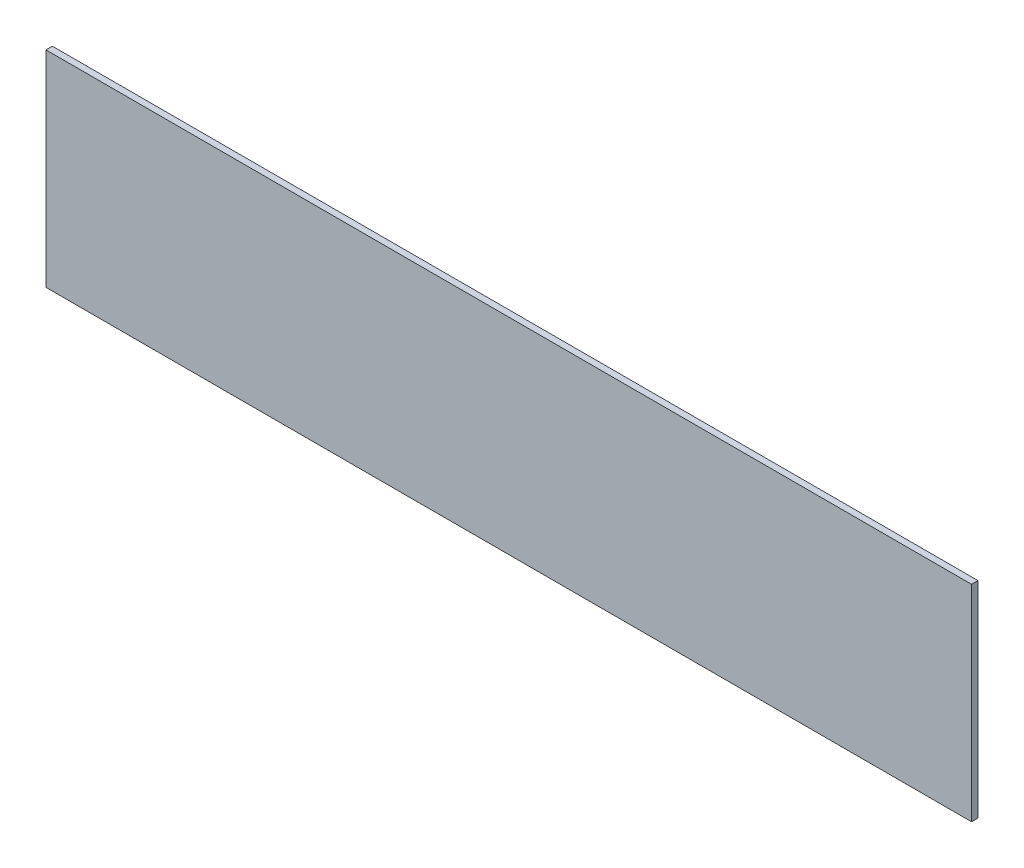
ISO-10303-21;
HEADER;
FILE_DESCRIPTION(('STEP AP214'),'2;1');
FILE_NAME('part.step','',(''),(''),'','','');
FILE_SCHEMA(('AUTOMOTIVE_DESIGN { 1 0 10303 214 1 1 1 1 }'));
ENDSEC;
DATA;
#1=APPLICATION_CONTEXT('core data for automotive mechanical design processes');
#2=APPLICATION_PROTOCOL_DEFINITION('international standard','automotive_design',2000,#1);
#3=PRODUCT_CONTEXT('',#1,'mechanical');
#4=PRODUCT('Part','Part','',(#3));
#5=PRODUCT_RELATED_PRODUCT_CATEGORY('part','',(#4));
#6=PRODUCT_DEFINITION_FORMATION('','',#4);
#7=PRODUCT_DEFINITION_CONTEXT('part definition',#1,'design');
#8=PRODUCT_DEFINITION('design','',#6,#7);
#9=PRODUCT_DEFINITION_SHAPE('','',#8);
#10=(LENGTH_UNIT() NAMED_UNIT(*) SI_UNIT(.MILLI.,.METRE.));
#11=(NAMED_UNIT(*) PLANE_ANGLE_UNIT() SI_UNIT($,.RADIAN.));
#12=(NAMED_UNIT(*) SI_UNIT($,.STERADIAN.) SOLID_ANGLE_UNIT());
#13=UNCERTAINTY_MEASURE_WITH_UNIT(LENGTH_MEASURE(1.E-05),#10,'distance_accuracy_value','');
#14=(GEOMETRIC_REPRESENTATION_CONTEXT(3) GLOBAL_UNCERTAINTY_ASSIGNED_CONTEXT((#13)) GLOBAL_UNIT_ASSIGNED_CONTEXT((#10,
#11,#12)) REPRESENTATION_CONTEXT('',''));
#15=CARTESIAN_POINT('',(0.,0.,0.));
#16=DIRECTION('',(0.,0.,1.));
#17=DIRECTION('',(1.,0.,0.));
#18=AXIS2_PLACEMENT_3D('',#15,#16,#17);
#19=CARTESIAN_POINT('',(0.,0.,1.5875));
#20=DIRECTION('',(-1.,0.,0.));
#21=DIRECTION('',(0.,0.,1.));
#22=AXIS2_PLACEMENT_3D('',#19,#20,#21);
#23=PLANE('',#22);
#24=DIRECTION('',(0.,1.,0.));
#25=VECTOR('',#24,1.);
#26=CARTESIAN_POINT('',(0.,0.,0.));
#27=LINE('',#26,#25);
#28=CARTESIAN_POINT('',(0.,-50.8,0.));
#29=VERTEX_POINT('',#28);
#30=CARTESIAN_POINT('',(0.,0.,0.));
#31=VERTEX_POINT('',#30);
#32=EDGE_CURVE('E97',#29,#31,#27,.T.);
#33=ORIENTED_EDGE('',*,*,#32,.T.);
#34=DIRECTION('',(0.,0.,-1.));
#35=VECTOR('',#34,1.);
#36=CARTESIAN_POINT('',(0.,0.,1.5875));
#37=LINE('',#36,#35);
#38=CARTESIAN_POINT('',(0.,0.,1.5875));
#39=VERTEX_POINT('',#38);
#40=EDGE_CURVE('E11',#39,#31,#37,.T.);
#41=ORIENTED_EDGE('',*,*,#40,.F.);
#42=DIRECTION('',(0.,1.,0.));
#43=VECTOR('',#42,1.);
#44=CARTESIAN_POINT('',(0.,0.,1.5875));
#45=LINE('',#44,#43);
#46=CARTESIAN_POINT('',(0.,-50.8,1.5875));
#47=VERTEX_POINT('',#46);
#48=EDGE_CURVE('E85',#47,#39,#45,.T.);
#49=ORIENTED_EDGE('',*,*,#48,.F.);
#50=DIRECTION('',(0.,0.,-1.));
#51=VECTOR('',#50,1.);
#52=CARTESIAN_POINT('',(0.,-50.8,1.5875));
#53=LINE('',#52,#51);
#54=EDGE_CURVE('E93',#47,#29,#53,.T.);
#55=ORIENTED_EDGE('',*,*,#54,.T.);
#56=EDGE_LOOP('',(#33,#41,#49,#55));
#57=FACE_BOUND('',#56,.T.);
#58=ADVANCED_FACE('F34',(#57),#23,.F.);
#59=CARTESIAN_POINT('',(0.,0.,1.5875));
#60=DIRECTION('',(0.,-1.,0.));
#61=DIRECTION('',(1.,0.,0.));
#62=AXIS2_PLACEMENT_3D('',#59,#60,#61);
#63=PLANE('',#62);
#64=DIRECTION('',(-1.,0.,0.));
#65=VECTOR('',#64,1.);
#66=CARTESIAN_POINT('',(0.,0.,0.));
#67=LINE('',#66,#65);
#68=CARTESIAN_POINT('',(-228.6,0.,0.));
#69=VERTEX_POINT('',#68);
#70=EDGE_CURVE('E89',#31,#69,#67,.T.);
#71=ORIENTED_EDGE('',*,*,#70,.T.);
#72=DIRECTION('',(0.,0.,-1.));
#73=VECTOR('',#72,1.);
#74=CARTESIAN_POINT('',(-228.6,0.,1.5875));
#75=LINE('',#74,#73);
#76=CARTESIAN_POINT('',(-228.6,0.,1.5875));
#77=VERTEX_POINT('',#76);
#78=EDGE_CURVE('E42',#77,#69,#75,.T.);
#79=ORIENTED_EDGE('',*,*,#78,.F.);
#80=DIRECTION('',(-1.,0.,0.));
#81=VECTOR('',#80,1.);
#82=CARTESIAN_POINT('',(0.,0.,1.5875));
#83=LINE('',#82,#81);
#84=EDGE_CURVE('E80',#39,#77,#83,.T.);
#85=ORIENTED_EDGE('',*,*,#84,.F.);
#86=ORIENTED_EDGE('',*,*,#40,.T.);
#87=EDGE_LOOP('',(#71,#79,#85,#86));
#88=FACE_BOUND('',#87,.T.);
#89=ADVANCED_FACE('F88',(#88),#63,.F.);
#90=CARTESIAN_POINT('',(-228.6,0.,1.5875));
#91=DIRECTION('',(1.,0.,0.));
#92=DIRECTION('',(0.,0.,-1.));
#93=AXIS2_PLACEMENT_3D('',#90,#91,#92);
#94=PLANE('',#93);
#95=DIRECTION('',(0.,-1.,0.));
#96=VECTOR('',#95,1.);
#97=CARTESIAN_POINT('',(-228.6,0.,0.));
#98=LINE('',#97,#96);
#99=CARTESIAN_POINT('',(-228.6,-50.8,0.));
#100=VERTEX_POINT('',#99);
#101=EDGE_CURVE('E67',#69,#100,#98,.T.);
#102=ORIENTED_EDGE('',*,*,#101,.T.);
#103=DIRECTION('',(0.,0.,-1.));
#104=VECTOR('',#103,1.);
#105=CARTESIAN_POINT('',(-228.6,-50.8,1.5875));
#106=LINE('',#105,#104);
#107=CARTESIAN_POINT('',(-228.6,-50.8,1.5875));
#108=VERTEX_POINT('',#107);
#109=EDGE_CURVE('E90',#108,#100,#106,.T.);
#110=ORIENTED_EDGE('',*,*,#109,.F.);
#111=DIRECTION('',(0.,-1.,0.));
#112=VECTOR('',#111,1.);
#113=CARTESIAN_POINT('',(-228.6,0.,1.5875));
#114=LINE('',#113,#112);
#115=EDGE_CURVE('E83',#77,#108,#114,.T.);
#116=ORIENTED_EDGE('',*,*,#115,.F.);
#117=ORIENTED_EDGE('',*,*,#78,.T.);
#118=EDGE_LOOP('',(#102,#110,#116,#117));
#119=FACE_BOUND('',#118,.T.);
#120=ADVANCED_FACE('F91',(#119),#94,.F.);
#121=CARTESIAN_POINT('',(0.,-50.8,1.5875));
#122=DIRECTION('',(0.,1.,0.));
#123=DIRECTION('',(-1.,0.,0.));
#124=AXIS2_PLACEMENT_3D('',#121,#122,#123);
#125=PLANE('',#124);
#126=DIRECTION('',(1.,0.,0.));
#127=VECTOR('',#126,1.);
#128=CARTESIAN_POINT('',(0.,-50.8,0.));
#129=LINE('',#128,#127);
#130=EDGE_CURVE('E73',#100,#29,#129,.T.);
#131=ORIENTED_EDGE('',*,*,#130,.T.);
#132=ORIENTED_EDGE('',*,*,#54,.F.);
#133=DIRECTION('',(1.,0.,0.));
#134=VECTOR('',#133,1.);
#135=CARTESIAN_POINT('',(0.,-50.8,1.5875));
#136=LINE('',#135,#134);
#137=EDGE_CURVE('E50',#108,#47,#136,.T.);
#138=ORIENTED_EDGE('',*,*,#137,.F.);
#139=ORIENTED_EDGE('',*,*,#109,.T.);
#140=EDGE_LOOP('',(#131,#132,#138,#139));
#141=FACE_BOUND('',#140,.T.);
#142=ADVANCED_FACE('F104',(#141),#125,.F.);
#143=CARTESIAN_POINT('',(0.,0.,1.5875));
#144=DIRECTION('',(0.,0.,-1.));
#145=DIRECTION('',(-1.,0.,0.));
#146=AXIS2_PLACEMENT_3D('',#143,#144,#145);
#147=PLANE('',#146);
#148=ORIENTED_EDGE('',*,*,#48,.T.);
#149=ORIENTED_EDGE('',*,*,#84,.T.);
#150=ORIENTED_EDGE('',*,*,#115,.T.);
#151=ORIENTED_EDGE('',*,*,#137,.T.);
#152=EDGE_LOOP('',(#148,#149,#150,#151));
#153=FACE_BOUND('',#152,.T.);
#154=ADVANCED_FACE('F81',(#153),#147,.F.);
#155=CARTESIAN_POINT('',(0.,0.,0.));
#156=DIRECTION('',(0.,0.,-1.));
#157=DIRECTION('',(-1.,0.,0.));
#158=AXIS2_PLACEMENT_3D('',#155,#156,#157);
#159=PLANE('',#158);
#160=ORIENTED_EDGE('',*,*,#32,.F.);
#161=ORIENTED_EDGE('',*,*,#130,.F.);
#162=ORIENTED_EDGE('',*,*,#101,.F.);
#163=ORIENTED_EDGE('',*,*,#70,.F.);
#164=EDGE_LOOP('',(#160,#161,#162,#163));
#165=FACE_BOUND('',#164,.T.);
#166=ADVANCED_FACE('F107',(#165),#159,.T.);
#167=CLOSED_SHELL('',(#58,#89,#120,#142,#154,#166));
#168=MANIFOLD_SOLID_BREP('B2',#167);
#169=ADVANCED_BREP_SHAPE_REPRESENTATION('',(#18,#168),#14);
#170=SHAPE_DEFINITION_REPRESENTATION(#9,#169);
ENDSEC;
END-ISO-10303-21;
